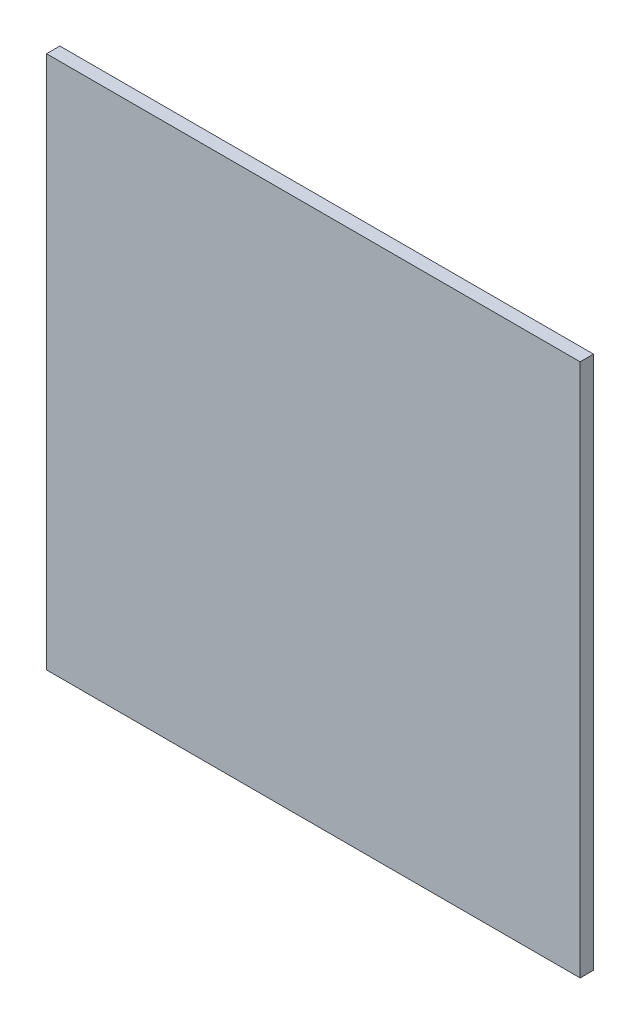
ISO-10303-21;
HEADER;
FILE_DESCRIPTION(('STEP AP214'),'2;1');
FILE_NAME('part.step','',(''),(''),'','','');
FILE_SCHEMA(('AUTOMOTIVE_DESIGN { 1 0 10303 214 1 1 1 1 }'));
ENDSEC;
DATA;
#1=APPLICATION_CONTEXT('core data for automotive mechanical design processes');
#2=APPLICATION_PROTOCOL_DEFINITION('international standard','automotive_design',2000,#1);
#3=PRODUCT_CONTEXT('',#1,'mechanical');
#4=PRODUCT('Part','Part','',(#3));
#5=PRODUCT_RELATED_PRODUCT_CATEGORY('part','',(#4));
#6=PRODUCT_DEFINITION_FORMATION('','',#4);
#7=PRODUCT_DEFINITION_CONTEXT('part definition',#1,'design');
#8=PRODUCT_DEFINITION('design','',#6,#7);
#9=PRODUCT_DEFINITION_SHAPE('','',#8);
#10=(LENGTH_UNIT() NAMED_UNIT(*) SI_UNIT(.MILLI.,.METRE.));
#11=(NAMED_UNIT(*) PLANE_ANGLE_UNIT() SI_UNIT($,.RADIAN.));
#12=(NAMED_UNIT(*) SI_UNIT($,.STERADIAN.) SOLID_ANGLE_UNIT());
#13=UNCERTAINTY_MEASURE_WITH_UNIT(LENGTH_MEASURE(1.E-05),#10,'distance_accuracy_value','');
#14=(GEOMETRIC_REPRESENTATION_CONTEXT(3) GLOBAL_UNCERTAINTY_ASSIGNED_CONTEXT((#13)) GLOBAL_UNIT_ASSIGNED_CONTEXT((#10,
#11,#12)) REPRESENTATION_CONTEXT('',''));
#15=CARTESIAN_POINT('',(0.,0.,0.));
#16=DIRECTION('',(0.,0.,1.));
#17=DIRECTION('',(1.,0.,0.));
#18=AXIS2_PLACEMENT_3D('',#15,#16,#17);
#19=CARTESIAN_POINT('',(400.,-400.,20.));
#20=DIRECTION('',(-1.,0.,0.));
#21=DIRECTION('',(0.,0.,1.));
#22=AXIS2_PLACEMENT_3D('',#19,#20,#21);
#23=PLANE('',#22);
#24=DIRECTION('',(0.,1.,0.));
#25=VECTOR('',#24,1.);
#26=CARTESIAN_POINT('',(400.,-400.,0.));
#27=LINE('',#26,#25);
#28=CARTESIAN_POINT('',(400.,-400.,0.));
#29=VERTEX_POINT('',#28);
#30=CARTESIAN_POINT('',(400.,400.,0.));
#31=VERTEX_POINT('',#30);
#32=EDGE_CURVE('E113',#29,#31,#27,.T.);
#33=ORIENTED_EDGE('',*,*,#32,.T.);
#34=DIRECTION('',(0.,0.,-1.));
#35=VECTOR('',#34,1.);
#36=CARTESIAN_POINT('',(400.,400.,20.));
#37=LINE('',#36,#35);
#38=CARTESIAN_POINT('',(400.,400.,20.));
#39=VERTEX_POINT('',#38);
#40=EDGE_CURVE('E11',#39,#31,#37,.T.);
#41=ORIENTED_EDGE('',*,*,#40,.F.);
#42=DIRECTION('',(0.,1.,0.));
#43=VECTOR('',#42,1.);
#44=CARTESIAN_POINT('',(400.,-400.,20.));
#45=LINE('',#44,#43);
#46=CARTESIAN_POINT('',(400.,-400.,20.));
#47=VERTEX_POINT('',#46);
#48=EDGE_CURVE('E97',#47,#39,#45,.T.);
#49=ORIENTED_EDGE('',*,*,#48,.F.);
#50=DIRECTION('',(0.,0.,-1.));
#51=VECTOR('',#50,1.);
#52=CARTESIAN_POINT('',(400.,-400.,20.));
#53=LINE('',#52,#51);
#54=EDGE_CURVE('E109',#47,#29,#53,.T.);
#55=ORIENTED_EDGE('',*,*,#54,.T.);
#56=EDGE_LOOP('',(#33,#41,#49,#55));
#57=FACE_BOUND('',#56,.T.);
#58=ADVANCED_FACE('F45',(#57),#23,.F.);
#59=CARTESIAN_POINT('',(-400.,400.,20.));
#60=DIRECTION('',(0.,-1.,0.));
#61=DIRECTION('',(0.,0.,-1.));
#62=AXIS2_PLACEMENT_3D('',#59,#60,#61);
#63=PLANE('',#62);
#64=DIRECTION('',(-1.,0.,0.));
#65=VECTOR('',#64,1.);
#66=CARTESIAN_POINT('',(-400.,400.,0.));
#67=LINE('',#66,#65);
#68=CARTESIAN_POINT('',(-400.,400.,0.));
#69=VERTEX_POINT('',#68);
#70=EDGE_CURVE('E102',#31,#69,#67,.T.);
#71=ORIENTED_EDGE('',*,*,#70,.T.);
#72=DIRECTION('',(0.,0.,-1.));
#73=VECTOR('',#72,1.);
#74=CARTESIAN_POINT('',(-400.,400.,20.));
#75=LINE('',#74,#73);
#76=CARTESIAN_POINT('',(-400.,400.,20.));
#77=VERTEX_POINT('',#76);
#78=EDGE_CURVE('E54',#77,#69,#75,.T.);
#79=ORIENTED_EDGE('',*,*,#78,.F.);
#80=DIRECTION('',(-1.,0.,0.));
#81=VECTOR('',#80,1.);
#82=CARTESIAN_POINT('',(-400.,400.,20.));
#83=LINE('',#82,#81);
#84=EDGE_CURVE('E92',#39,#77,#83,.T.);
#85=ORIENTED_EDGE('',*,*,#84,.F.);
#86=ORIENTED_EDGE('',*,*,#40,.T.);
#87=EDGE_LOOP('',(#71,#79,#85,#86));
#88=FACE_BOUND('',#87,.T.);
#89=ADVANCED_FACE('F101',(#88),#63,.F.);
#90=CARTESIAN_POINT('',(-400.,-400.,20.));
#91=DIRECTION('',(1.,0.,0.));
#92=DIRECTION('',(0.,0.,-1.));
#93=AXIS2_PLACEMENT_3D('',#90,#91,#92);
#94=PLANE('',#93);
#95=DIRECTION('',(0.,-1.,0.));
#96=VECTOR('',#95,1.);
#97=CARTESIAN_POINT('',(-400.,-400.,0.));
#98=LINE('',#97,#96);
#99=CARTESIAN_POINT('',(-400.,-400.,0.));
#100=VERTEX_POINT('',#99);
#101=EDGE_CURVE('E79',#69,#100,#98,.T.);
#102=ORIENTED_EDGE('',*,*,#101,.T.);
#103=DIRECTION('',(0.,0.,-1.));
#104=VECTOR('',#103,1.);
#105=CARTESIAN_POINT('',(-400.,-400.,20.));
#106=LINE('',#105,#104);
#107=CARTESIAN_POINT('',(-400.,-400.,20.));
#108=VERTEX_POINT('',#107);
#109=EDGE_CURVE('E104',#108,#100,#106,.T.);
#110=ORIENTED_EDGE('',*,*,#109,.F.);
#111=DIRECTION('',(0.,-1.,0.));
#112=VECTOR('',#111,1.);
#113=CARTESIAN_POINT('',(-400.,-400.,20.));
#114=LINE('',#113,#112);
#115=EDGE_CURVE('E95',#77,#108,#114,.T.);
#116=ORIENTED_EDGE('',*,*,#115,.F.);
#117=ORIENTED_EDGE('',*,*,#78,.T.);
#118=EDGE_LOOP('',(#102,#110,#116,#117));
#119=FACE_BOUND('',#118,.T.);
#120=ADVANCED_FACE('F105',(#119),#94,.F.);
#121=CARTESIAN_POINT('',(-400.,-400.,20.));
#122=DIRECTION('',(0.,1.,0.));
#123=DIRECTION('',(0.,0.,1.));
#124=AXIS2_PLACEMENT_3D('',#121,#122,#123);
#125=PLANE('',#124);
#126=DIRECTION('',(1.,0.,0.));
#127=VECTOR('',#126,1.);
#128=CARTESIAN_POINT('',(-400.,-400.,0.));
#129=LINE('',#128,#127);
#130=EDGE_CURVE('E85',#100,#29,#129,.T.);
#131=ORIENTED_EDGE('',*,*,#130,.T.);
#132=ORIENTED_EDGE('',*,*,#54,.F.);
#133=DIRECTION('',(1.,0.,0.));
#134=VECTOR('',#133,1.);
#135=CARTESIAN_POINT('',(-400.,-400.,20.));
#136=LINE('',#135,#134);
#137=EDGE_CURVE('E62',#108,#47,#136,.T.);
#138=ORIENTED_EDGE('',*,*,#137,.F.);
#139=ORIENTED_EDGE('',*,*,#109,.T.);
#140=EDGE_LOOP('',(#131,#132,#138,#139));
#141=FACE_BOUND('',#140,.T.);
#142=ADVANCED_FACE('F126',(#141),#125,.F.);
#143=CARTESIAN_POINT('',(0.,0.,20.));
#144=DIRECTION('',(0.,0.,-1.));
#145=DIRECTION('',(-1.,0.,0.));
#146=AXIS2_PLACEMENT_3D('',#143,#144,#145);
#147=PLANE('',#146);
#148=ORIENTED_EDGE('',*,*,#48,.T.);
#149=ORIENTED_EDGE('',*,*,#84,.T.);
#150=ORIENTED_EDGE('',*,*,#115,.T.);
#151=ORIENTED_EDGE('',*,*,#137,.T.);
#152=EDGE_LOOP('',(#148,#149,#150,#151));
#153=FACE_BOUND('',#152,.T.);
#154=ADVANCED_FACE('F93',(#153),#147,.F.);
#155=CARTESIAN_POINT('',(0.,0.,0.));
#156=DIRECTION('',(0.,0.,-1.));
#157=DIRECTION('',(-1.,0.,0.));
#158=AXIS2_PLACEMENT_3D('',#155,#156,#157);
#159=PLANE('',#158);
#160=ORIENTED_EDGE('',*,*,#32,.F.);
#161=ORIENTED_EDGE('',*,*,#130,.F.);
#162=ORIENTED_EDGE('',*,*,#101,.F.);
#163=ORIENTED_EDGE('',*,*,#70,.F.);
#164=EDGE_LOOP('',(#160,#161,#162,#163));
#165=FACE_BOUND('',#164,.T.);
#166=ADVANCED_FACE('F129',(#165),#159,.T.);
#167=CLOSED_SHELL('',(#58,#89,#120,#142,#154,#166));
#168=MANIFOLD_SOLID_BREP('B2',#167);
#169=ADVANCED_BREP_SHAPE_REPRESENTATION('',(#18,#168),#14);
#170=SHAPE_DEFINITION_REPRESENTATION(#9,#169);
ENDSEC;
END-ISO-10303-21;
